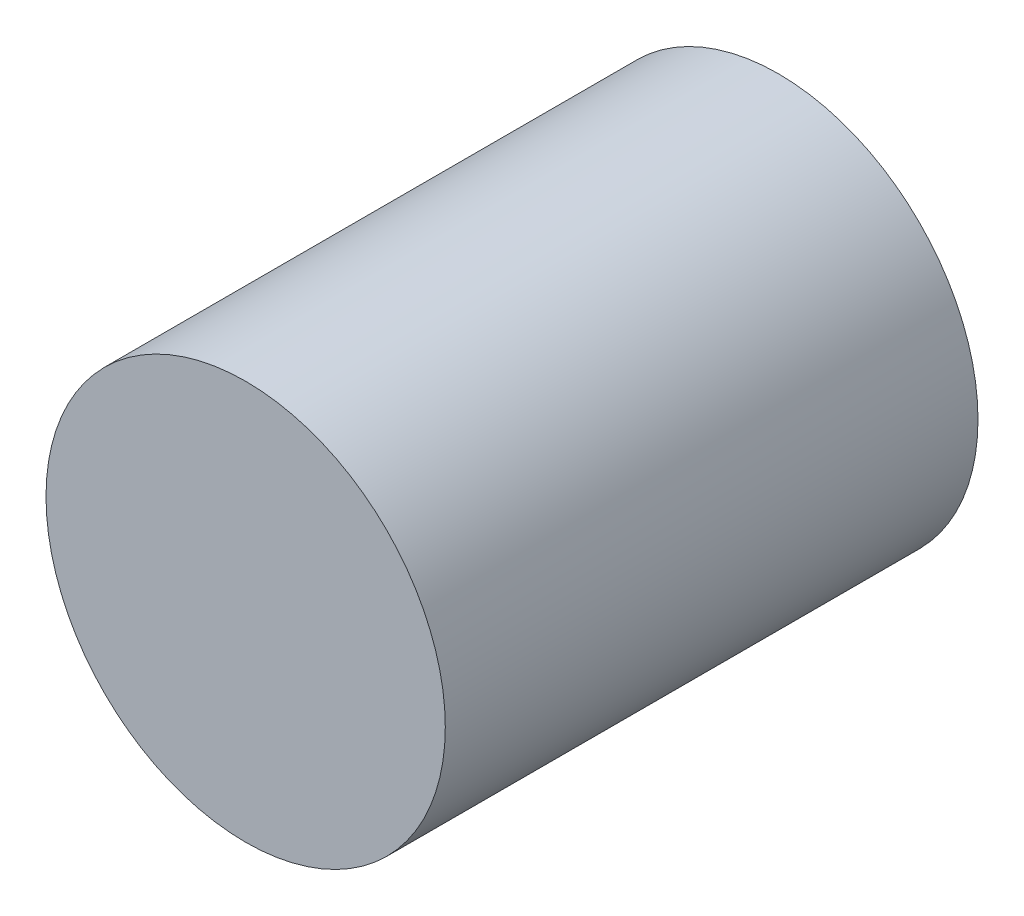
ISO-10303-21;
HEADER;
FILE_DESCRIPTION(('STEP AP214'),'2;1');
FILE_NAME('part.step','',(''),(''),'','','');
FILE_SCHEMA(('AUTOMOTIVE_DESIGN { 1 0 10303 214 1 1 1 1 }'));
ENDSEC;
DATA;
#1=APPLICATION_CONTEXT('core data for automotive mechanical design processes');
#2=APPLICATION_PROTOCOL_DEFINITION('international standard','automotive_design',2000,#1);
#3=PRODUCT_CONTEXT('',#1,'mechanical');
#4=PRODUCT('Part','Part','',(#3));
#5=PRODUCT_RELATED_PRODUCT_CATEGORY('part','',(#4));
#6=PRODUCT_DEFINITION_FORMATION('','',#4);
#7=PRODUCT_DEFINITION_CONTEXT('part definition',#1,'design');
#8=PRODUCT_DEFINITION('design','',#6,#7);
#9=PRODUCT_DEFINITION_SHAPE('','',#8);
#10=(LENGTH_UNIT() NAMED_UNIT(*) SI_UNIT(.MILLI.,.METRE.));
#11=(NAMED_UNIT(*) PLANE_ANGLE_UNIT() SI_UNIT($,.RADIAN.));
#12=(NAMED_UNIT(*) SI_UNIT($,.STERADIAN.) SOLID_ANGLE_UNIT());
#13=UNCERTAINTY_MEASURE_WITH_UNIT(LENGTH_MEASURE(1.E-05),#10,'distance_accuracy_value','');
#14=(GEOMETRIC_REPRESENTATION_CONTEXT(3) GLOBAL_UNCERTAINTY_ASSIGNED_CONTEXT((#13)) GLOBAL_UNIT_ASSIGNED_CONTEXT((#10,
#11,#12)) REPRESENTATION_CONTEXT('',''));
#15=CARTESIAN_POINT('',(0.,0.,0.));
#16=DIRECTION('',(0.,0.,1.));
#17=DIRECTION('',(1.,0.,0.));
#18=AXIS2_PLACEMENT_3D('',#15,#16,#17);
#19=CARTESIAN_POINT('',(0.,0.,12.7));
#20=DIRECTION('',(0.,0.,-1.));
#21=DIRECTION('',(-1.,0.,0.));
#22=AXIS2_PLACEMENT_3D('',#19,#20,#21);
#23=CYLINDRICAL_SURFACE('',#22,4.76);
#24=CARTESIAN_POINT('',(0.,0.,12.7));
#25=DIRECTION('',(0.,0.,1.));
#26=DIRECTION('',(1.,0.,0.));
#27=AXIS2_PLACEMENT_3D('',#24,#25,#26);
#28=CIRCLE('',#27,4.76);
#29=CARTESIAN_POINT('',(4.76,0.,12.7));
#30=VERTEX_POINT('',#29);
#31=EDGE_CURVE('E10',#30,#30,#28,.T.);
#32=ORIENTED_EDGE('',*,*,#31,.F.);
#33=EDGE_LOOP('',(#32));
#34=FACE_BOUND('',#33,.T.);
#35=CARTESIAN_POINT('',(0.,0.,0.));
#36=DIRECTION('',(0.,0.,1.));
#37=DIRECTION('',(1.,0.,0.));
#38=AXIS2_PLACEMENT_3D('',#35,#36,#37);
#39=CIRCLE('',#38,4.76);
#40=CARTESIAN_POINT('',(4.76,0.,0.));
#41=VERTEX_POINT('',#40);
#42=EDGE_CURVE('E34',#41,#41,#39,.T.);
#43=ORIENTED_EDGE('',*,*,#42,.T.);
#44=EDGE_LOOP('',(#43));
#45=FACE_BOUND('',#44,.T.);
#46=ADVANCED_FACE('F31',(#34,#45),#23,.T.);
#47=CARTESIAN_POINT('',(0.,0.,12.7));
#48=DIRECTION('',(0.,0.,1.));
#49=DIRECTION('',(1.,0.,0.));
#50=AXIS2_PLACEMENT_3D('',#47,#48,#49);
#51=PLANE('',#50);
#52=ORIENTED_EDGE('',*,*,#31,.T.);
#53=EDGE_LOOP('',(#52));
#54=FACE_BOUND('',#53,.T.);
#55=ADVANCED_FACE('F46',(#54),#51,.T.);
#56=CARTESIAN_POINT('',(0.,0.,0.));
#57=DIRECTION('',(0.,0.,1.));
#58=DIRECTION('',(1.,0.,0.));
#59=AXIS2_PLACEMENT_3D('',#56,#57,#58);
#60=PLANE('',#59);
#61=ORIENTED_EDGE('',*,*,#42,.F.);
#62=EDGE_LOOP('',(#61));
#63=FACE_BOUND('',#62,.T.);
#64=ADVANCED_FACE('F44',(#63),#60,.F.);
#65=CLOSED_SHELL('',(#46,#55,#64));
#66=MANIFOLD_SOLID_BREP('B2',#65);
#67=ADVANCED_BREP_SHAPE_REPRESENTATION('',(#18,#66),#14);
#68=SHAPE_DEFINITION_REPRESENTATION(#9,#67);
ENDSEC;
END-ISO-10303-21;
